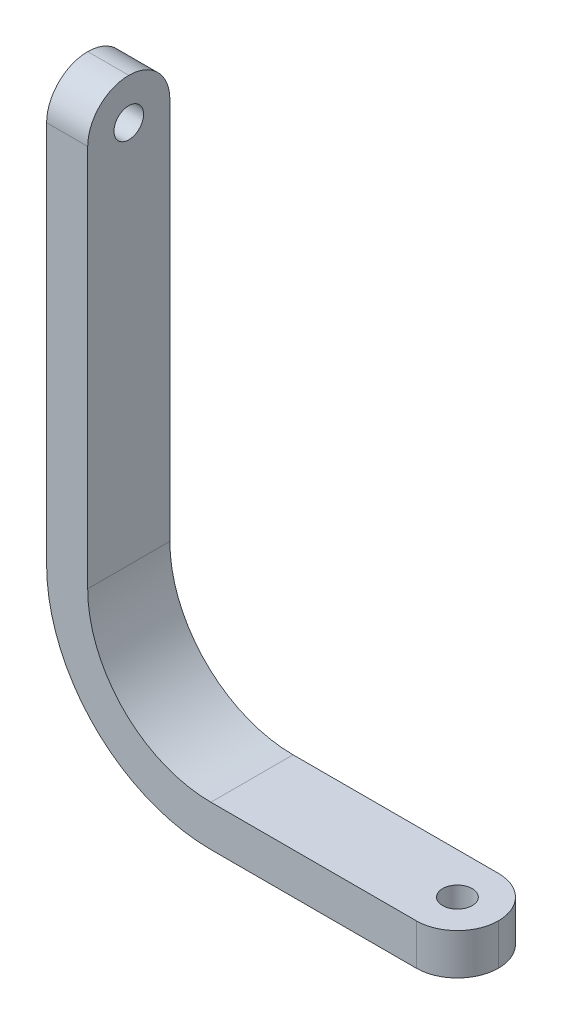
ISO-10303-21;
HEADER;
FILE_DESCRIPTION(('STEP AP214'),'2;1');
FILE_NAME('part.step','',(''),(''),'','','');
FILE_SCHEMA(('AUTOMOTIVE_DESIGN { 1 0 10303 214 1 1 1 1 }'));
ENDSEC;
DATA;
#1=APPLICATION_CONTEXT('core data for automotive mechanical design processes');
#2=APPLICATION_PROTOCOL_DEFINITION('international standard','automotive_design',2000,#1);
#3=PRODUCT_CONTEXT('',#1,'mechanical');
#4=PRODUCT('Part','Part','',(#3));
#5=PRODUCT_RELATED_PRODUCT_CATEGORY('part','',(#4));
#6=PRODUCT_DEFINITION_FORMATION('','',#4);
#7=PRODUCT_DEFINITION_CONTEXT('part definition',#1,'design');
#8=PRODUCT_DEFINITION('design','',#6,#7);
#9=PRODUCT_DEFINITION_SHAPE('','',#8);
#10=(LENGTH_UNIT() NAMED_UNIT(*) SI_UNIT(.MILLI.,.METRE.));
#11=(NAMED_UNIT(*) PLANE_ANGLE_UNIT() SI_UNIT($,.RADIAN.));
#12=(NAMED_UNIT(*) SI_UNIT($,.STERADIAN.) SOLID_ANGLE_UNIT());
#13=UNCERTAINTY_MEASURE_WITH_UNIT(LENGTH_MEASURE(1.E-05),#10,'distance_accuracy_value','');
#14=(GEOMETRIC_REPRESENTATION_CONTEXT(3) GLOBAL_UNCERTAINTY_ASSIGNED_CONTEXT((#13)) GLOBAL_UNIT_ASSIGNED_CONTEXT((#10,
#11,#12)) REPRESENTATION_CONTEXT('',''));
#15=CARTESIAN_POINT('',(0.,0.,0.));
#16=DIRECTION('',(0.,0.,1.));
#17=DIRECTION('',(1.,0.,0.));
#18=AXIS2_PLACEMENT_3D('',#15,#16,#17);
#19=CARTESIAN_POINT('',(-50.,20.,10.));
#20=DIRECTION('',(1.,0.,0.));
#21=DIRECTION('',(0.,0.,-1.));
#22=AXIS2_PLACEMENT_3D('',#19,#20,#21);
#23=PLANE('',#22);
#24=CARTESIAN_POINT('',(-50.,66.627417,5.));
#25=DIRECTION('',(1.,0.,0.));
#26=DIRECTION('',(0.,0.,-1.));
#27=AXIS2_PLACEMENT_3D('',#24,#25,#26);
#28=CIRCLE('',#27,5.);
#29=CARTESIAN_POINT('',(-50.,66.627417,10.));
#30=VERTEX_POINT('',#29);
#31=CARTESIAN_POINT('',(-50.,71.627417,5.));
#32=VERTEX_POINT('',#31);
#33=EDGE_CURVE('E69',#30,#32,#28,.F.);
#34=ORIENTED_EDGE('',*,*,#33,.T.);
#35=CARTESIAN_POINT('',(-50.,66.627417,5.));
#36=DIRECTION('',(1.,0.,0.));
#37=DIRECTION('',(0.,0.,-1.));
#38=AXIS2_PLACEMENT_3D('',#35,#36,#37);
#39=CIRCLE('',#38,5.);
#40=CARTESIAN_POINT('',(-50.,66.627417,0.));
#41=VERTEX_POINT('',#40);
#42=EDGE_CURVE('E221',#32,#41,#39,.F.);
#43=ORIENTED_EDGE('',*,*,#42,.T.);
#44=DIRECTION('',(0.,-1.,0.));
#45=VECTOR('',#44,1.);
#46=CARTESIAN_POINT('',(-50.,20.,0.));
#47=LINE('',#46,#45);
#48=CARTESIAN_POINT('',(-50.,20.,0.));
#49=VERTEX_POINT('',#48);
#50=EDGE_CURVE('E178',#41,#49,#47,.T.);
#51=ORIENTED_EDGE('',*,*,#50,.T.);
#52=DIRECTION('',(0.,0.,-1.));
#53=VECTOR('',#52,1.);
#54=CARTESIAN_POINT('',(-50.,20.,10.));
#55=LINE('',#54,#53);
#56=CARTESIAN_POINT('',(-50.,20.,10.));
#57=VERTEX_POINT('',#56);
#58=EDGE_CURVE('E190',#57,#49,#55,.T.);
#59=ORIENTED_EDGE('',*,*,#58,.F.);
#60=DIRECTION('',(0.,-1.,0.));
#61=VECTOR('',#60,1.);
#62=CARTESIAN_POINT('',(-50.,20.,10.));
#63=LINE('',#62,#61);
#64=EDGE_CURVE('E156',#30,#57,#63,.T.);
#65=ORIENTED_EDGE('',*,*,#64,.F.);
#66=EDGE_LOOP('',(#34,#43,#51,#59,#65));
#67=FACE_BOUND('',#66,.T.);
#68=CARTESIAN_POINT('',(-50.,66.627417,5.));
#69=DIRECTION('',(-1.,0.,0.));
#70=DIRECTION('',(0.,0.,1.));
#71=AXIS2_PLACEMENT_3D('',#68,#69,#70);
#72=CIRCLE('',#71,1.79999999999998);
#73=CARTESIAN_POINT('',(-50.,66.627417,6.79999999999998));
#74=VERTEX_POINT('',#73);
#75=EDGE_CURVE('E248',#74,#74,#72,.T.);
#76=ORIENTED_EDGE('',*,*,#75,.F.);
#77=EDGE_LOOP('',(#76));
#78=FACE_BOUND('',#77,.T.);
#79=ADVANCED_FACE('F45',(#67,#78),#23,.F.);
#80=CARTESIAN_POINT('',(-30.,5.,10.));
#81=DIRECTION('',(0.,-1.,0.));
#82=DIRECTION('',(1.,0.,0.));
#83=AXIS2_PLACEMENT_3D('',#80,#81,#82);
#84=PLANE('',#83);
#85=CARTESIAN_POINT('',(-5.,5.,5.));
#86=DIRECTION('',(0.,-1.,0.));
#87=DIRECTION('',(1.,0.,0.));
#88=AXIS2_PLACEMENT_3D('',#85,#86,#87);
#89=CIRCLE('',#88,1.79999999999999);
#90=CARTESIAN_POINT('',(-3.20000000000001,5.,5.));
#91=VERTEX_POINT('',#90);
#92=EDGE_CURVE('E232',#91,#91,#89,.T.);
#93=ORIENTED_EDGE('',*,*,#92,.T.);
#94=EDGE_LOOP('',(#93));
#95=FACE_BOUND('',#94,.T.);
#96=DIRECTION('',(-1.,0.,0.));
#97=VECTOR('',#96,1.);
#98=CARTESIAN_POINT('',(-30.,5.,10.));
#99=LINE('',#98,#97);
#100=CARTESIAN_POINT('',(-5.,5.,10.));
#101=VERTEX_POINT('',#100);
#102=CARTESIAN_POINT('',(-30.,5.,10.));
#103=VERTEX_POINT('',#102);
#104=EDGE_CURVE('E124',#101,#103,#99,.T.);
#105=ORIENTED_EDGE('',*,*,#104,.F.);
#106=CARTESIAN_POINT('',(-5.,5.,5.));
#107=DIRECTION('',(0.,-1.,0.));
#108=DIRECTION('',(1.,0.,0.));
#109=AXIS2_PLACEMENT_3D('',#106,#107,#108);
#110=CIRCLE('',#109,5.);
#111=CARTESIAN_POINT('',(0.,5.,5.));
#112=VERTEX_POINT('',#111);
#113=EDGE_CURVE('E203',#101,#112,#110,.F.);
#114=ORIENTED_EDGE('',*,*,#113,.T.);
#115=CARTESIAN_POINT('',(-5.,5.,5.));
#116=DIRECTION('',(0.,-1.,0.));
#117=DIRECTION('',(1.,0.,0.));
#118=AXIS2_PLACEMENT_3D('',#115,#116,#117);
#119=CIRCLE('',#118,5.);
#120=CARTESIAN_POINT('',(-5.,5.,0.));
#121=VERTEX_POINT('',#120);
#122=EDGE_CURVE('E200',#112,#121,#119,.F.);
#123=ORIENTED_EDGE('',*,*,#122,.T.);
#124=DIRECTION('',(-1.,0.,0.));
#125=VECTOR('',#124,1.);
#126=CARTESIAN_POINT('',(-30.,5.,0.));
#127=LINE('',#126,#125);
#128=CARTESIAN_POINT('',(-30.,5.,0.));
#129=VERTEX_POINT('',#128);
#130=EDGE_CURVE('E142',#121,#129,#127,.T.);
#131=ORIENTED_EDGE('',*,*,#130,.T.);
#132=DIRECTION('',(0.,0.,-1.));
#133=VECTOR('',#132,1.);
#134=CARTESIAN_POINT('',(-30.,5.,10.));
#135=LINE('',#134,#133);
#136=EDGE_CURVE('E139',#103,#129,#135,.T.);
#137=ORIENTED_EDGE('',*,*,#136,.F.);
#138=EDGE_LOOP('',(#105,#114,#123,#131,#137));
#139=FACE_BOUND('',#138,.T.);
#140=ADVANCED_FACE('F140',(#95,#139),#84,.F.);
#141=CARTESIAN_POINT('',(-30.,20.,10.));
#142=DIRECTION('',(0.,0.,-1.));
#143=DIRECTION('',(-1.,0.,0.));
#144=AXIS2_PLACEMENT_3D('',#141,#142,#143);
#145=CYLINDRICAL_SURFACE('',#144,15.);
#146=CARTESIAN_POINT('',(-30.,20.,0.));
#147=DIRECTION('',(0.,0.,-1.));
#148=DIRECTION('',(1.,0.,0.));
#149=AXIS2_PLACEMENT_3D('',#146,#147,#148);
#150=CIRCLE('',#149,15.);
#151=CARTESIAN_POINT('',(-45.,20.,0.));
#152=VERTEX_POINT('',#151);
#153=EDGE_CURVE('E171',#129,#152,#150,.T.);
#154=ORIENTED_EDGE('',*,*,#153,.T.);
#155=DIRECTION('',(0.,0.,-1.));
#156=VECTOR('',#155,1.);
#157=CARTESIAN_POINT('',(-45.,20.,10.));
#158=LINE('',#157,#156);
#159=CARTESIAN_POINT('',(-45.,20.,10.));
#160=VERTEX_POINT('',#159);
#161=EDGE_CURVE('E147',#160,#152,#158,.T.);
#162=ORIENTED_EDGE('',*,*,#161,.F.);
#163=CARTESIAN_POINT('',(-30.,20.,10.));
#164=DIRECTION('',(0.,0.,-1.));
#165=DIRECTION('',(1.,0.,0.));
#166=AXIS2_PLACEMENT_3D('',#163,#164,#165);
#167=CIRCLE('',#166,15.);
#168=EDGE_CURVE('E130',#103,#160,#167,.T.);
#169=ORIENTED_EDGE('',*,*,#168,.F.);
#170=ORIENTED_EDGE('',*,*,#136,.T.);
#171=EDGE_LOOP('',(#154,#162,#169,#170));
#172=FACE_BOUND('',#171,.T.);
#173=ADVANCED_FACE('F149',(#172),#145,.F.);
#174=CARTESIAN_POINT('',(-45.,71.627417,10.));
#175=DIRECTION('',(-1.,0.,0.));
#176=DIRECTION('',(0.,-1.,0.));
#177=AXIS2_PLACEMENT_3D('',#174,#175,#176);
#178=PLANE('',#177);
#179=CARTESIAN_POINT('',(-45.,66.627417,5.));
#180=DIRECTION('',(-1.,0.,0.));
#181=DIRECTION('',(0.,-1.,0.));
#182=AXIS2_PLACEMENT_3D('',#179,#180,#181);
#183=CIRCLE('',#182,1.79999999999999);
#184=CARTESIAN_POINT('',(-45.,64.827417,5.));
#185=VERTEX_POINT('',#184);
#186=EDGE_CURVE('E242',#185,#185,#183,.T.);
#187=ORIENTED_EDGE('',*,*,#186,.T.);
#188=EDGE_LOOP('',(#187));
#189=FACE_BOUND('',#188,.T.);
#190=DIRECTION('',(0.,1.,0.));
#191=VECTOR('',#190,1.);
#192=CARTESIAN_POINT('',(-45.,71.627417,0.));
#193=LINE('',#192,#191);
#194=CARTESIAN_POINT('',(-45.,66.627417,0.));
#195=VERTEX_POINT('',#194);
#196=EDGE_CURVE('E175',#152,#195,#193,.T.);
#197=ORIENTED_EDGE('',*,*,#196,.T.);
#198=CARTESIAN_POINT('',(-45.,66.627417,5.));
#199=DIRECTION('',(-1.,0.,0.));
#200=DIRECTION('',(0.,-1.,0.));
#201=AXIS2_PLACEMENT_3D('',#198,#199,#200);
#202=CIRCLE('',#201,5.);
#203=CARTESIAN_POINT('',(-45.,71.627417,5.));
#204=VERTEX_POINT('',#203);
#205=EDGE_CURVE('E11',#195,#204,#202,.F.);
#206=ORIENTED_EDGE('',*,*,#205,.T.);
#207=CARTESIAN_POINT('',(-45.,66.627417,5.));
#208=DIRECTION('',(-1.,0.,0.));
#209=DIRECTION('',(0.,-1.,0.));
#210=AXIS2_PLACEMENT_3D('',#207,#208,#209);
#211=CIRCLE('',#210,5.);
#212=CARTESIAN_POINT('',(-45.,66.627417,10.));
#213=VERTEX_POINT('',#212);
#214=EDGE_CURVE('E55',#204,#213,#211,.F.);
#215=ORIENTED_EDGE('',*,*,#214,.T.);
#216=DIRECTION('',(0.,1.,0.));
#217=VECTOR('',#216,1.);
#218=CARTESIAN_POINT('',(-45.,71.627417,10.));
#219=LINE('',#218,#217);
#220=EDGE_CURVE('E153',#160,#213,#219,.T.);
#221=ORIENTED_EDGE('',*,*,#220,.F.);
#222=ORIENTED_EDGE('',*,*,#161,.T.);
#223=EDGE_LOOP('',(#197,#206,#215,#221,#222));
#224=FACE_BOUND('',#223,.T.);
#225=ADVANCED_FACE('F267',(#189,#224),#178,.F.);
#226=CARTESIAN_POINT('',(-30.,20.,10.));
#227=DIRECTION('',(0.,0.,-1.));
#228=DIRECTION('',(-1.,0.,0.));
#229=AXIS2_PLACEMENT_3D('',#226,#227,#228);
#230=CYLINDRICAL_SURFACE('',#229,20.);
#231=CARTESIAN_POINT('',(-30.,20.,0.));
#232=DIRECTION('',(0.,0.,1.));
#233=DIRECTION('',(1.,0.,0.));
#234=AXIS2_PLACEMENT_3D('',#231,#232,#233);
#235=CIRCLE('',#234,20.);
#236=CARTESIAN_POINT('',(-30.,0.,0.));
#237=VERTEX_POINT('',#236);
#238=EDGE_CURVE('E181',#49,#237,#235,.T.);
#239=ORIENTED_EDGE('',*,*,#238,.T.);
#240=DIRECTION('',(0.,0.,-1.));
#241=VECTOR('',#240,1.);
#242=CARTESIAN_POINT('',(-30.,0.,10.));
#243=LINE('',#242,#241);
#244=CARTESIAN_POINT('',(-30.,0.,10.));
#245=VERTEX_POINT('',#244);
#246=EDGE_CURVE('E168',#245,#237,#243,.T.);
#247=ORIENTED_EDGE('',*,*,#246,.F.);
#248=CARTESIAN_POINT('',(-30.,20.,10.));
#249=DIRECTION('',(0.,0.,1.));
#250=DIRECTION('',(1.,0.,0.));
#251=AXIS2_PLACEMENT_3D('',#248,#249,#250);
#252=CIRCLE('',#251,20.);
#253=EDGE_CURVE('E162',#57,#245,#252,.T.);
#254=ORIENTED_EDGE('',*,*,#253,.F.);
#255=ORIENTED_EDGE('',*,*,#58,.T.);
#256=EDGE_LOOP('',(#239,#247,#254,#255));
#257=FACE_BOUND('',#256,.T.);
#258=ADVANCED_FACE('F265',(#257),#230,.T.);
#259=CARTESIAN_POINT('',(0.,0.,10.));
#260=DIRECTION('',(0.,1.,0.));
#261=DIRECTION('',(-1.,0.,0.));
#262=AXIS2_PLACEMENT_3D('',#259,#260,#261);
#263=PLANE('',#262);
#264=CARTESIAN_POINT('',(-5.,0.,5.));
#265=DIRECTION('',(0.,-1.,0.));
#266=DIRECTION('',(0.,0.,-1.));
#267=AXIS2_PLACEMENT_3D('',#264,#265,#266);
#268=CIRCLE('',#267,1.79999999999999);
#269=CARTESIAN_POINT('',(-5.,0.,3.20000000000001));
#270=VERTEX_POINT('',#269);
#271=EDGE_CURVE('E237',#270,#270,#268,.T.);
#272=ORIENTED_EDGE('',*,*,#271,.F.);
#273=EDGE_LOOP('',(#272));
#274=FACE_BOUND('',#273,.T.);
#275=CARTESIAN_POINT('',(-5.,0.,5.));
#276=DIRECTION('',(0.,1.,0.));
#277=DIRECTION('',(-1.,0.,0.));
#278=AXIS2_PLACEMENT_3D('',#275,#276,#277);
#279=CIRCLE('',#278,5.);
#280=CARTESIAN_POINT('',(-5.,0.,0.));
#281=VERTEX_POINT('',#280);
#282=CARTESIAN_POINT('',(0.,0.,5.));
#283=VERTEX_POINT('',#282);
#284=EDGE_CURVE('E206',#281,#283,#279,.F.);
#285=ORIENTED_EDGE('',*,*,#284,.T.);
#286=CARTESIAN_POINT('',(-5.,0.,5.));
#287=DIRECTION('',(0.,1.,0.));
#288=DIRECTION('',(-1.,0.,0.));
#289=AXIS2_PLACEMENT_3D('',#286,#287,#288);
#290=CIRCLE('',#289,5.);
#291=CARTESIAN_POINT('',(-5.,0.,10.));
#292=VERTEX_POINT('',#291);
#293=EDGE_CURVE('E209',#283,#292,#290,.F.);
#294=ORIENTED_EDGE('',*,*,#293,.T.);
#295=DIRECTION('',(1.,0.,0.));
#296=VECTOR('',#295,1.);
#297=CARTESIAN_POINT('',(0.,0.,10.));
#298=LINE('',#297,#296);
#299=EDGE_CURVE('E165',#245,#292,#298,.T.);
#300=ORIENTED_EDGE('',*,*,#299,.F.);
#301=ORIENTED_EDGE('',*,*,#246,.T.);
#302=DIRECTION('',(1.,0.,0.));
#303=VECTOR('',#302,1.);
#304=CARTESIAN_POINT('',(0.,0.,0.));
#305=LINE('',#304,#303);
#306=EDGE_CURVE('E136',#237,#281,#305,.T.);
#307=ORIENTED_EDGE('',*,*,#306,.T.);
#308=EDGE_LOOP('',(#285,#294,#300,#301,#307));
#309=FACE_BOUND('',#308,.T.);
#310=ADVANCED_FACE('F302',(#274,#309),#263,.F.);
#311=CARTESIAN_POINT('',(-30.,20.,10.));
#312=DIRECTION('',(0.,0.,1.));
#313=DIRECTION('',(1.,0.,0.));
#314=AXIS2_PLACEMENT_3D('',#311,#312,#313);
#315=PLANE('',#314);
#316=ORIENTED_EDGE('',*,*,#299,.T.);
#317=DIRECTION('',(0.,1.,0.));
#318=VECTOR('',#317,1.);
#319=CARTESIAN_POINT('',(-5.,5.,10.));
#320=LINE('',#319,#318);
#321=EDGE_CURVE('E133',#292,#101,#320,.T.);
#322=ORIENTED_EDGE('',*,*,#321,.T.);
#323=ORIENTED_EDGE('',*,*,#104,.T.);
#324=ORIENTED_EDGE('',*,*,#168,.T.);
#325=ORIENTED_EDGE('',*,*,#220,.T.);
#326=DIRECTION('',(-1.,0.,0.));
#327=VECTOR('',#326,1.);
#328=CARTESIAN_POINT('',(-50.,66.627417,10.));
#329=LINE('',#328,#327);
#330=EDGE_CURVE('E146',#213,#30,#329,.T.);
#331=ORIENTED_EDGE('',*,*,#330,.T.);
#332=ORIENTED_EDGE('',*,*,#64,.T.);
#333=ORIENTED_EDGE('',*,*,#253,.T.);
#334=EDGE_LOOP('',(#316,#322,#323,#324,#325,#331,#332,#333));
#335=FACE_BOUND('',#334,.T.);
#336=ADVANCED_FACE('F127',(#335),#315,.T.);
#337=CARTESIAN_POINT('',(-30.,20.,0.));
#338=DIRECTION('',(0.,0.,1.));
#339=DIRECTION('',(1.,0.,0.));
#340=AXIS2_PLACEMENT_3D('',#337,#338,#339);
#341=PLANE('',#340);
#342=ORIENTED_EDGE('',*,*,#130,.F.);
#343=DIRECTION('',(0.,1.,0.));
#344=VECTOR('',#343,1.);
#345=CARTESIAN_POINT('',(-5.,20.,0.));
#346=LINE('',#345,#344);
#347=EDGE_CURVE('E216',#121,#281,#346,.F.);
#348=ORIENTED_EDGE('',*,*,#347,.T.);
#349=ORIENTED_EDGE('',*,*,#306,.F.);
#350=ORIENTED_EDGE('',*,*,#238,.F.);
#351=ORIENTED_EDGE('',*,*,#50,.F.);
#352=DIRECTION('',(-1.,0.,0.));
#353=VECTOR('',#352,1.);
#354=CARTESIAN_POINT('',(-30.,66.627417,0.));
#355=LINE('',#354,#353);
#356=EDGE_CURVE('E212',#41,#195,#355,.F.);
#357=ORIENTED_EDGE('',*,*,#356,.T.);
#358=ORIENTED_EDGE('',*,*,#196,.F.);
#359=ORIENTED_EDGE('',*,*,#153,.F.);
#360=EDGE_LOOP('',(#342,#348,#349,#350,#351,#357,#358,#359));
#361=FACE_BOUND('',#360,.T.);
#362=ADVANCED_FACE('F277',(#361),#341,.F.);
#363=CARTESIAN_POINT('',(-5.,5.,5.));
#364=DIRECTION('',(0.,1.,0.));
#365=DIRECTION('',(-1.,0.,0.));
#366=AXIS2_PLACEMENT_3D('',#363,#364,#365);
#367=CYLINDRICAL_SURFACE('',#366,5.);
#368=DIRECTION('',(0.,1.,0.));
#369=VECTOR('',#368,1.);
#370=CARTESIAN_POINT('',(0.,5.,5.));
#371=LINE('',#370,#369);
#372=EDGE_CURVE('E172',#283,#112,#371,.T.);
#373=ORIENTED_EDGE('',*,*,#372,.F.);
#374=ORIENTED_EDGE('',*,*,#284,.F.);
#375=ORIENTED_EDGE('',*,*,#347,.F.);
#376=ORIENTED_EDGE('',*,*,#122,.F.);
#377=EDGE_LOOP('',(#373,#374,#375,#376));
#378=FACE_BOUND('',#377,.T.);
#379=ADVANCED_FACE('F275',(#378),#367,.T.);
#380=CARTESIAN_POINT('',(-5.,20.,5.));
#381=DIRECTION('',(0.,-1.,0.));
#382=DIRECTION('',(1.,0.,0.));
#383=AXIS2_PLACEMENT_3D('',#380,#381,#382);
#384=CYLINDRICAL_SURFACE('',#383,5.);
#385=ORIENTED_EDGE('',*,*,#293,.F.);
#386=ORIENTED_EDGE('',*,*,#372,.T.);
#387=ORIENTED_EDGE('',*,*,#113,.F.);
#388=ORIENTED_EDGE('',*,*,#321,.F.);
#389=EDGE_LOOP('',(#385,#386,#387,#388));
#390=FACE_BOUND('',#389,.T.);
#391=ADVANCED_FACE('F272',(#390),#384,.T.);
#392=CARTESIAN_POINT('',(-30.,66.627417,5.));
#393=DIRECTION('',(1.,0.,0.));
#394=DIRECTION('',(0.,0.,-1.));
#395=AXIS2_PLACEMENT_3D('',#392,#393,#394);
#396=CYLINDRICAL_SURFACE('',#395,5.);
#397=ORIENTED_EDGE('',*,*,#330,.F.);
#398=ORIENTED_EDGE('',*,*,#214,.F.);
#399=DIRECTION('',(-1.,0.,0.));
#400=VECTOR('',#399,1.);
#401=CARTESIAN_POINT('',(-45.,71.627417,5.));
#402=LINE('',#401,#400);
#403=EDGE_CURVE('E49',#32,#204,#402,.F.);
#404=ORIENTED_EDGE('',*,*,#403,.F.);
#405=ORIENTED_EDGE('',*,*,#33,.F.);
#406=EDGE_LOOP('',(#397,#398,#404,#405));
#407=FACE_BOUND('',#406,.T.);
#408=ADVANCED_FACE('F47',(#407),#396,.T.);
#409=CARTESIAN_POINT('',(-50.,66.627417,5.));
#410=DIRECTION('',(-1.,0.,0.));
#411=DIRECTION('',(0.,0.,1.));
#412=AXIS2_PLACEMENT_3D('',#409,#410,#411);
#413=CYLINDRICAL_SURFACE('',#412,5.);
#414=ORIENTED_EDGE('',*,*,#205,.F.);
#415=ORIENTED_EDGE('',*,*,#356,.F.);
#416=ORIENTED_EDGE('',*,*,#42,.F.);
#417=ORIENTED_EDGE('',*,*,#403,.T.);
#418=EDGE_LOOP('',(#414,#415,#416,#417));
#419=FACE_BOUND('',#418,.T.);
#420=ADVANCED_FACE('F279',(#419),#413,.T.);
#421=CARTESIAN_POINT('',(-5.,0.,5.));
#422=DIRECTION('',(0.,-1.,0.));
#423=DIRECTION('',(0.,0.,-1.));
#424=AXIS2_PLACEMENT_3D('',#421,#422,#423);
#425=CYLINDRICAL_SURFACE('',#424,1.79999999999999);
#426=ORIENTED_EDGE('',*,*,#92,.F.);
#427=EDGE_LOOP('',(#426));
#428=FACE_BOUND('',#427,.T.);
#429=ORIENTED_EDGE('',*,*,#271,.T.);
#430=EDGE_LOOP('',(#429));
#431=FACE_BOUND('',#430,.T.);
#432=ADVANCED_FACE('F281',(#428,#431),#425,.F.);
#433=CARTESIAN_POINT('',(-50.,66.627417,5.));
#434=DIRECTION('',(-1.,0.,0.));
#435=DIRECTION('',(0.,0.,1.));
#436=AXIS2_PLACEMENT_3D('',#433,#434,#435);
#437=CYLINDRICAL_SURFACE('',#436,1.79999999999999);
#438=ORIENTED_EDGE('',*,*,#186,.F.);
#439=EDGE_LOOP('',(#438));
#440=FACE_BOUND('',#439,.T.);
#441=ORIENTED_EDGE('',*,*,#75,.T.);
#442=EDGE_LOOP('',(#441));
#443=FACE_BOUND('',#442,.T.);
#444=ADVANCED_FACE('F253',(#440,#443),#437,.F.);
#445=CLOSED_SHELL('',(#79,#140,#173,#225,#258,#310,#336,#362,#379,#391,#408,#420,#432,#444));
#446=MANIFOLD_SOLID_BREP('B2',#445);
#447=ADVANCED_BREP_SHAPE_REPRESENTATION('',(#18,#446),#14);
#448=SHAPE_DEFINITION_REPRESENTATION(#9,#447);
ENDSEC;
END-ISO-10303-21;
